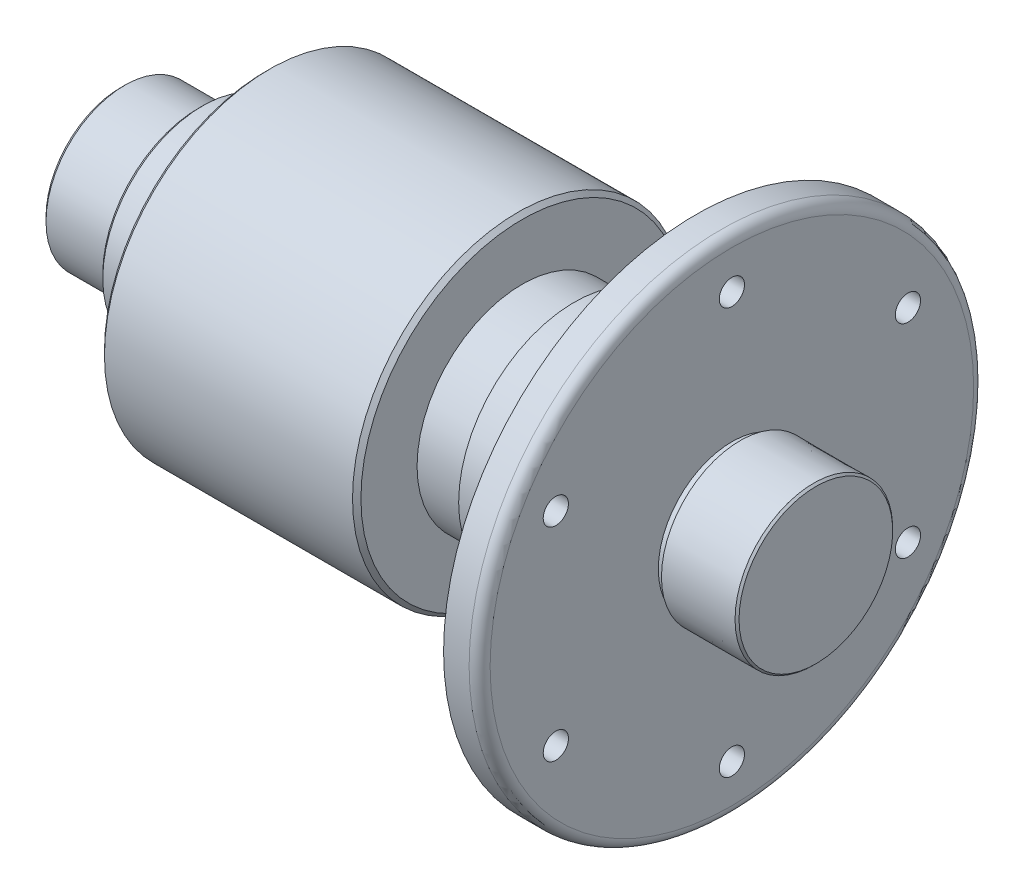
ISO-10303-21;
HEADER;
FILE_DESCRIPTION(('STEP AP214'),'2;1');
FILE_NAME('part.step','',(''),(''),'','','');
FILE_SCHEMA(('AUTOMOTIVE_DESIGN { 1 0 10303 214 1 1 1 1 }'));
ENDSEC;
DATA;
#1=APPLICATION_CONTEXT('core data for automotive mechanical design processes');
#2=APPLICATION_PROTOCOL_DEFINITION('international standard','automotive_design',2000,#1);
#3=PRODUCT_CONTEXT('',#1,'mechanical');
#4=PRODUCT('Part','Part','',(#3));
#5=PRODUCT_RELATED_PRODUCT_CATEGORY('part','',(#4));
#6=PRODUCT_DEFINITION_FORMATION('','',#4);
#7=PRODUCT_DEFINITION_CONTEXT('part definition',#1,'design');
#8=PRODUCT_DEFINITION('design','',#6,#7);
#9=PRODUCT_DEFINITION_SHAPE('','',#8);
#10=(LENGTH_UNIT() NAMED_UNIT(*) SI_UNIT(.MILLI.,.METRE.));
#11=(NAMED_UNIT(*) PLANE_ANGLE_UNIT() SI_UNIT($,.RADIAN.));
#12=(NAMED_UNIT(*) SI_UNIT($,.STERADIAN.) SOLID_ANGLE_UNIT());
#13=UNCERTAINTY_MEASURE_WITH_UNIT(LENGTH_MEASURE(1.E-05),#10,'distance_accuracy_value','');
#14=(GEOMETRIC_REPRESENTATION_CONTEXT(3) GLOBAL_UNCERTAINTY_ASSIGNED_CONTEXT((#13)) GLOBAL_UNIT_ASSIGNED_CONTEXT((#10,
#11,#12)) REPRESENTATION_CONTEXT('',''));
#15=CARTESIAN_POINT('',(0.,0.,0.));
#16=DIRECTION('',(0.,0.,1.));
#17=DIRECTION('',(1.,0.,0.));
#18=AXIS2_PLACEMENT_3D('',#15,#16,#17);
#19=CARTESIAN_POINT('',(25.8615467573256,47.7414329405358,0.));
#20=DIRECTION('',(1.,0.,0.));
#21=DIRECTION('',(0.,0.,-1.));
#22=AXIS2_PLACEMENT_3D('',#19,#20,#21);
#23=CONICAL_SURFACE('',#22,55.0000000000026,1.03037682652439);
#24=CARTESIAN_POINT('',(22.8615467573229,47.7414329405358,0.));
#25=DIRECTION('',(-1.,0.,0.));
#26=DIRECTION('',(0.,0.,1.));
#27=AXIS2_PLACEMENT_3D('',#24,#25,#26);
#28=CIRCLE('',#27,49.9999999999973);
#29=CARTESIAN_POINT('',(22.8615467573229,47.7414329405358,49.9999999999973));
#30=VERTEX_POINT('',#29);
#31=EDGE_CURVE('E11',#30,#30,#28,.T.);
#32=ORIENTED_EDGE('',*,*,#31,.F.);
#33=EDGE_LOOP('',(#32));
#34=FACE_BOUND('',#33,.T.);
#35=CARTESIAN_POINT('',(25.8615467573256,47.7414329405358,0.));
#36=DIRECTION('',(-1.,0.,0.));
#37=DIRECTION('',(0.,0.,1.));
#38=AXIS2_PLACEMENT_3D('',#35,#36,#37);
#39=CIRCLE('',#38,55.0000000000026);
#40=CARTESIAN_POINT('',(25.8615467573256,47.7414329405358,55.0000000000026));
#41=VERTEX_POINT('',#40);
#42=EDGE_CURVE('E75',#41,#41,#39,.T.);
#43=ORIENTED_EDGE('',*,*,#42,.T.);
#44=EDGE_LOOP('',(#43));
#45=FACE_BOUND('',#44,.T.);
#46=ADVANCED_FACE('F37',(#34,#45),#23,.T.);
#47=CARTESIAN_POINT('',(-189.925603217158,47.7414329405358,0.));
#48=DIRECTION('',(-1.,0.,0.));
#49=DIRECTION('',(0.,0.,1.));
#50=AXIS2_PLACEMENT_3D('',#47,#48,#49);
#51=CYLINDRICAL_SURFACE('',#50,49.9999999999973);
#52=CARTESIAN_POINT('',(1.07439678284377,47.7414329405358,0.));
#53=DIRECTION('',(-1.,0.,0.));
#54=DIRECTION('',(0.,0.,1.));
#55=AXIS2_PLACEMENT_3D('',#52,#53,#54);
#56=CIRCLE('',#55,49.9999999999973);
#57=CARTESIAN_POINT('',(1.07439678284377,47.7414329405358,49.9999999999973));
#58=VERTEX_POINT('',#57);
#59=EDGE_CURVE('E43',#58,#58,#56,.T.);
#60=ORIENTED_EDGE('',*,*,#59,.F.);
#61=EDGE_LOOP('',(#60));
#62=FACE_BOUND('',#61,.T.);
#63=ORIENTED_EDGE('',*,*,#31,.T.);
#64=EDGE_LOOP('',(#63));
#65=FACE_BOUND('',#64,.T.);
#66=ADVANCED_FACE('F64',(#62,#65),#51,.T.);
#67=CARTESIAN_POINT('',(1.07439678284305,0.,0.));
#68=DIRECTION('',(1.,0.,0.));
#69=DIRECTION('',(0.,0.,-1.));
#70=AXIS2_PLACEMENT_3D('',#67,#68,#69);
#71=PLANE('',#70);
#72=ORIENTED_EDGE('',*,*,#59,.T.);
#73=EDGE_LOOP('',(#72));
#74=FACE_BOUND('',#73,.T.);
#75=CARTESIAN_POINT('',(1.07439678284232,47.7414329405358,0.));
#76=DIRECTION('',(-1.,0.,0.));
#77=DIRECTION('',(0.,0.,1.));
#78=AXIS2_PLACEMENT_3D('',#75,#76,#77);
#79=CIRCLE('',#78,76.7000000000024);
#80=CARTESIAN_POINT('',(1.07439678284232,47.7414329405358,76.7000000000024));
#81=VERTEX_POINT('',#80);
#82=EDGE_CURVE('E153',#81,#81,#79,.T.);
#83=ORIENTED_EDGE('',*,*,#82,.F.);
#84=EDGE_LOOP('',(#83));
#85=FACE_BOUND('',#84,.T.);
#86=ADVANCED_FACE('F69',(#74,#85),#71,.T.);
#87=CARTESIAN_POINT('',(1.07439678284232,47.7414329405358,0.));
#88=DIRECTION('',(-1.,0.,0.));
#89=DIRECTION('',(0.,0.,1.));
#90=AXIS2_PLACEMENT_3D('',#87,#88,#89);
#91=CONICAL_SURFACE('',#90,76.7000000000024,0.785398163397442);
#92=CARTESIAN_POINT('',(-0.925603217157678,47.7414329405358,0.));
#93=DIRECTION('',(-1.,0.,0.));
#94=DIRECTION('',(0.,0.,1.));
#95=AXIS2_PLACEMENT_3D('',#92,#93,#94);
#96=CIRCLE('',#95,78.7000000000024);
#97=CARTESIAN_POINT('',(-0.925603217157678,47.7414329405358,78.7000000000024));
#98=VERTEX_POINT('',#97);
#99=EDGE_CURVE('E150',#98,#98,#96,.T.);
#100=ORIENTED_EDGE('',*,*,#99,.F.);
#101=EDGE_LOOP('',(#100));
#102=FACE_BOUND('',#101,.T.);
#103=ORIENTED_EDGE('',*,*,#82,.T.);
#104=EDGE_LOOP('',(#103));
#105=FACE_BOUND('',#104,.T.);
#106=ADVANCED_FACE('F161',(#102,#105),#91,.T.);
#107=CARTESIAN_POINT('',(-189.925603217158,47.7414329405358,0.));
#108=DIRECTION('',(-1.,0.,0.));
#109=DIRECTION('',(0.,0.,1.));
#110=AXIS2_PLACEMENT_3D('',#107,#108,#109);
#111=CYLINDRICAL_SURFACE('',#110,78.7000000000018);
#112=CARTESIAN_POINT('',(-118.925603217158,47.7414329405358,0.));
#113=DIRECTION('',(-1.,0.,0.));
#114=DIRECTION('',(0.,0.,1.));
#115=AXIS2_PLACEMENT_3D('',#112,#113,#114);
#116=CIRCLE('',#115,78.7000000000012);
#117=CARTESIAN_POINT('',(-118.925603217158,47.7414329405358,78.7000000000012));
#118=VERTEX_POINT('',#117);
#119=EDGE_CURVE('E147',#118,#118,#116,.T.);
#120=ORIENTED_EDGE('',*,*,#119,.F.);
#121=EDGE_LOOP('',(#120));
#122=FACE_BOUND('',#121,.T.);
#123=ORIENTED_EDGE('',*,*,#99,.T.);
#124=EDGE_LOOP('',(#123));
#125=FACE_BOUND('',#124,.T.);
#126=ADVANCED_FACE('F166',(#122,#125),#111,.T.);
#127=CARTESIAN_POINT('',(-118.925603217158,47.7414329405358,0.));
#128=DIRECTION('',(1.,0.,0.));
#129=DIRECTION('',(0.,0.,-1.));
#130=AXIS2_PLACEMENT_3D('',#127,#128,#129);
#131=CONICAL_SURFACE('',#130,78.7000000000012,0.785398163397445);
#132=CARTESIAN_POINT('',(-120.925603217158,47.7414329405358,0.));
#133=DIRECTION('',(-1.,0.,0.));
#134=DIRECTION('',(0.,0.,1.));
#135=AXIS2_PLACEMENT_3D('',#132,#133,#134);
#136=CIRCLE('',#135,76.7000000000013);
#137=CARTESIAN_POINT('',(-120.925603217158,47.7414329405358,76.7000000000013));
#138=VERTEX_POINT('',#137);
#139=EDGE_CURVE('E144',#138,#138,#136,.T.);
#140=ORIENTED_EDGE('',*,*,#139,.F.);
#141=EDGE_LOOP('',(#140));
#142=FACE_BOUND('',#141,.T.);
#143=ORIENTED_EDGE('',*,*,#119,.T.);
#144=EDGE_LOOP('',(#143));
#145=FACE_BOUND('',#144,.T.);
#146=ADVANCED_FACE('F172',(#142,#145),#131,.T.);
#147=CARTESIAN_POINT('',(-120.925603217157,-2.81612374099351E-12,0.));
#148=DIRECTION('',(-1.,0.,0.));
#149=DIRECTION('',(0.,0.,1.));
#150=AXIS2_PLACEMENT_3D('',#147,#148,#149);
#151=PLANE('',#150);
#152=ORIENTED_EDGE('',*,*,#139,.T.);
#153=EDGE_LOOP('',(#152));
#154=FACE_BOUND('',#153,.T.);
#155=CARTESIAN_POINT('',(-120.925603217157,47.7414329405358,0.));
#156=DIRECTION('',(-1.,0.,0.));
#157=DIRECTION('',(0.,0.,1.));
#158=AXIS2_PLACEMENT_3D('',#155,#156,#157);
#159=CIRCLE('',#158,47.5000000000042);
#160=CARTESIAN_POINT('',(-120.925603217157,47.7414329405358,47.5000000000042));
#161=VERTEX_POINT('',#160);
#162=EDGE_CURVE('E141',#161,#161,#159,.T.);
#163=ORIENTED_EDGE('',*,*,#162,.F.);
#164=EDGE_LOOP('',(#163));
#165=FACE_BOUND('',#164,.T.);
#166=ADVANCED_FACE('F179',(#154,#165),#151,.T.);
#167=CARTESIAN_POINT('',(-189.925603217158,47.7414329405358,0.));
#168=DIRECTION('',(-1.,0.,0.));
#169=DIRECTION('',(0.,0.,1.));
#170=AXIS2_PLACEMENT_3D('',#167,#168,#169);
#171=CYLINDRICAL_SURFACE('',#170,47.5000000000042);
#172=CARTESIAN_POINT('',(-150.925603217157,47.7414329405358,0.));
#173=DIRECTION('',(-1.,0.,0.));
#174=DIRECTION('',(0.,0.,1.));
#175=AXIS2_PLACEMENT_3D('',#172,#173,#174);
#176=CIRCLE('',#175,47.5000000000042);
#177=CARTESIAN_POINT('',(-150.925603217157,47.7414329405358,47.5000000000042));
#178=VERTEX_POINT('',#177);
#179=EDGE_CURVE('E138',#178,#178,#176,.T.);
#180=ORIENTED_EDGE('',*,*,#179,.F.);
#181=EDGE_LOOP('',(#180));
#182=FACE_BOUND('',#181,.T.);
#183=ORIENTED_EDGE('',*,*,#162,.T.);
#184=EDGE_LOOP('',(#183));
#185=FACE_BOUND('',#184,.T.);
#186=ADVANCED_FACE('F183',(#182,#185),#171,.T.);
#187=CARTESIAN_POINT('',(-150.925603217157,47.7414329405358,0.));
#188=DIRECTION('',(1.,0.,0.));
#189=DIRECTION('',(0.,0.,-1.));
#190=AXIS2_PLACEMENT_3D('',#187,#188,#189);
#191=CONICAL_SURFACE('',#190,47.5000000000042,0.785398163397445);
#192=CARTESIAN_POINT('',(-152.925603217157,47.7414329405358,0.));
#193=DIRECTION('',(-1.,0.,0.));
#194=DIRECTION('',(0.,0.,1.));
#195=AXIS2_PLACEMENT_3D('',#192,#193,#194);
#196=CIRCLE('',#195,45.5000000000037);
#197=CARTESIAN_POINT('',(-152.925603217157,47.7414329405358,45.5000000000037));
#198=VERTEX_POINT('',#197);
#199=EDGE_CURVE('E135',#198,#198,#196,.T.);
#200=ORIENTED_EDGE('',*,*,#199,.F.);
#201=EDGE_LOOP('',(#200));
#202=FACE_BOUND('',#201,.T.);
#203=ORIENTED_EDGE('',*,*,#179,.T.);
#204=EDGE_LOOP('',(#203));
#205=FACE_BOUND('',#204,.T.);
#206=ADVANCED_FACE('F187',(#202,#205),#191,.T.);
#207=CARTESIAN_POINT('',(-152.925603217157,3.23393382373946E-12,0.));
#208=DIRECTION('',(1.,0.,0.));
#209=DIRECTION('',(0.,0.,-1.));
#210=AXIS2_PLACEMENT_3D('',#207,#208,#209);
#211=PLANE('',#210);
#212=CARTESIAN_POINT('',(-152.925603217158,47.7414329405358,0.));
#213=DIRECTION('',(-1.,0.,0.));
#214=DIRECTION('',(0.,0.,1.));
#215=AXIS2_PLACEMENT_3D('',#212,#213,#214);
#216=CIRCLE('',#215,35.);
#217=CARTESIAN_POINT('',(-152.925603217158,47.7414329405358,35.));
#218=VERTEX_POINT('',#217);
#219=EDGE_CURVE('E132',#218,#218,#216,.T.);
#220=ORIENTED_EDGE('',*,*,#219,.F.);
#221=EDGE_LOOP('',(#220));
#222=FACE_BOUND('',#221,.T.);
#223=ORIENTED_EDGE('',*,*,#199,.T.);
#224=EDGE_LOOP('',(#223));
#225=FACE_BOUND('',#224,.T.);
#226=ADVANCED_FACE('F191',(#222,#225),#211,.F.);
#227=CARTESIAN_POINT('',(-189.925603217158,47.7414329405358,0.));
#228=DIRECTION('',(-1.,0.,0.));
#229=DIRECTION('',(0.,0.,1.));
#230=AXIS2_PLACEMENT_3D('',#227,#228,#229);
#231=CYLINDRICAL_SURFACE('',#230,35.);
#232=CARTESIAN_POINT('',(-155.925603217158,47.7414329405358,0.));
#233=DIRECTION('',(-1.,0.,0.));
#234=DIRECTION('',(0.,0.,1.));
#235=AXIS2_PLACEMENT_3D('',#232,#233,#234);
#236=CIRCLE('',#235,35.);
#237=CARTESIAN_POINT('',(-155.925603217158,47.7414329405358,35.));
#238=VERTEX_POINT('',#237);
#239=EDGE_CURVE('E129',#238,#238,#236,.T.);
#240=ORIENTED_EDGE('',*,*,#239,.F.);
#241=EDGE_LOOP('',(#240));
#242=FACE_BOUND('',#241,.T.);
#243=ORIENTED_EDGE('',*,*,#219,.T.);
#244=EDGE_LOOP('',(#243));
#245=FACE_BOUND('',#244,.T.);
#246=ADVANCED_FACE('F195',(#242,#245),#231,.T.);
#247=CARTESIAN_POINT('',(-155.925603217158,0.,0.));
#248=DIRECTION('',(-1.,0.,0.));
#249=DIRECTION('',(0.,0.,1.));
#250=AXIS2_PLACEMENT_3D('',#247,#248,#249);
#251=PLANE('',#250);
#252=CARTESIAN_POINT('',(-155.925603217158,47.7414329405358,0.));
#253=DIRECTION('',(-1.,0.,0.));
#254=DIRECTION('',(0.,0.,1.));
#255=AXIS2_PLACEMENT_3D('',#252,#253,#254);
#256=CIRCLE('',#255,37.5);
#257=CARTESIAN_POINT('',(-155.925603217158,47.7414329405358,37.5));
#258=VERTEX_POINT('',#257);
#259=EDGE_CURVE('E126',#258,#258,#256,.T.);
#260=ORIENTED_EDGE('',*,*,#259,.F.);
#261=EDGE_LOOP('',(#260));
#262=FACE_BOUND('',#261,.T.);
#263=ORIENTED_EDGE('',*,*,#239,.T.);
#264=EDGE_LOOP('',(#263));
#265=FACE_BOUND('',#264,.T.);
#266=ADVANCED_FACE('F199',(#262,#265),#251,.F.);
#267=CARTESIAN_POINT('',(-189.925603217158,47.7414329405358,0.));
#268=DIRECTION('',(-1.,0.,0.));
#269=DIRECTION('',(0.,0.,1.));
#270=AXIS2_PLACEMENT_3D('',#267,#268,#269);
#271=CYLINDRICAL_SURFACE('',#270,37.5);
#272=CARTESIAN_POINT('',(-187.925603217158,47.7414329405358,0.));
#273=DIRECTION('',(-1.,0.,0.));
#274=DIRECTION('',(0.,0.,1.));
#275=AXIS2_PLACEMENT_3D('',#272,#273,#274);
#276=CIRCLE('',#275,37.5);
#277=CARTESIAN_POINT('',(-187.925603217158,47.7414329405358,37.5));
#278=VERTEX_POINT('',#277);
#279=EDGE_CURVE('E123',#278,#278,#276,.T.);
#280=ORIENTED_EDGE('',*,*,#279,.F.);
#281=EDGE_LOOP('',(#280));
#282=FACE_BOUND('',#281,.T.);
#283=ORIENTED_EDGE('',*,*,#259,.T.);
#284=EDGE_LOOP('',(#283));
#285=FACE_BOUND('',#284,.T.);
#286=ADVANCED_FACE('F203',(#282,#285),#271,.T.);
#287=CARTESIAN_POINT('',(-187.925603217158,47.7414329405358,0.));
#288=DIRECTION('',(1.,0.,0.));
#289=DIRECTION('',(0.,0.,-1.));
#290=AXIS2_PLACEMENT_3D('',#287,#288,#289);
#291=CONICAL_SURFACE('',#290,37.5,0.78539816339766);
#292=CARTESIAN_POINT('',(-189.925603217158,47.7414329405358,0.));
#293=DIRECTION('',(-1.,0.,0.));
#294=DIRECTION('',(0.,0.,1.));
#295=AXIS2_PLACEMENT_3D('',#292,#293,#294);
#296=CIRCLE('',#295,35.5);
#297=CARTESIAN_POINT('',(-189.925603217158,47.7414329405358,35.5));
#298=VERTEX_POINT('',#297);
#299=EDGE_CURVE('E120',#298,#298,#296,.T.);
#300=ORIENTED_EDGE('',*,*,#299,.F.);
#301=EDGE_LOOP('',(#300));
#302=FACE_BOUND('',#301,.T.);
#303=ORIENTED_EDGE('',*,*,#279,.T.);
#304=EDGE_LOOP('',(#303));
#305=FACE_BOUND('',#304,.T.);
#306=ADVANCED_FACE('F59',(#302,#305),#291,.T.);
#307=CARTESIAN_POINT('',(-189.925603217158,5.93971204669043E-13,0.));
#308=DIRECTION('',(-1.,0.,0.));
#309=DIRECTION('',(0.,0.,1.));
#310=AXIS2_PLACEMENT_3D('',#307,#308,#309);
#311=PLANE('',#310);
#312=ORIENTED_EDGE('',*,*,#299,.T.);
#313=EDGE_LOOP('',(#312));
#314=FACE_BOUND('',#313,.T.);
#315=ADVANCED_FACE('F49',(#314),#311,.T.);
#316=CARTESIAN_POINT('',(140.832653038409,47.7414329405358,0.));
#317=DIRECTION('',(-1.,0.,0.));
#318=DIRECTION('',(0.,0.,1.));
#319=AXIS2_PLACEMENT_3D('',#316,#317,#318);
#320=CONICAL_SURFACE('',#319,0.,1.56931244625037);
#321=CARTESIAN_POINT('',(140.778414132889,47.7414329405358,0.));
#322=DIRECTION('',(-1.,0.,0.));
#323=DIRECTION('',(0.,0.,1.));
#324=AXIS2_PLACEMENT_3D('',#321,#322,#323);
#325=CIRCLE('',#324,36.5520431616561);
#326=CARTESIAN_POINT('',(140.778414132889,47.7414329405358,36.5520431616561));
#327=VERTEX_POINT('',#326);
#328=EDGE_CURVE('E117',#327,#327,#325,.T.);
#329=ORIENTED_EDGE('',*,*,#328,.F.);
#330=EDGE_LOOP('',(#329));
#331=FACE_BOUND('',#330,.T.);
#332=CARTESIAN_POINT('',(140.832653038409,47.7414329405358,0.));
#333=VERTEX_POINT('',#332);
#334=VERTEX_LOOP('',#333);
#335=FACE_BOUND('',#334,.T.);
#336=ADVANCED_FACE('F46',(#331,#335),#320,.T.);
#337=CARTESIAN_POINT('',(140.778414132889,47.7414329405358,0.));
#338=DIRECTION('',(-1.,0.,0.));
#339=DIRECTION('',(0.,0.,1.));
#340=AXIS2_PLACEMENT_3D('',#337,#338,#339);
#341=CONICAL_SURFACE('',#340,36.5520431616561,0.785398163397441);
#342=CARTESIAN_POINT('',(139.832288889932,47.7414329405358,0.));
#343=DIRECTION('',(-1.,0.,0.));
#344=DIRECTION('',(0.,0.,1.));
#345=AXIS2_PLACEMENT_3D('',#342,#343,#344);
#346=CIRCLE('',#345,37.498168404613);
#347=CARTESIAN_POINT('',(139.832288889932,47.7414329405358,37.498168404613));
#348=VERTEX_POINT('',#347);
#349=EDGE_CURVE('E114',#348,#348,#346,.T.);
#350=ORIENTED_EDGE('',*,*,#349,.F.);
#351=EDGE_LOOP('',(#350));
#352=FACE_BOUND('',#351,.T.);
#353=ORIENTED_EDGE('',*,*,#328,.T.);
#354=EDGE_LOOP('',(#353));
#355=FACE_BOUND('',#354,.T.);
#356=ADVANCED_FACE('F48',(#352,#355),#341,.T.);
#357=CARTESIAN_POINT('',(139.832288889932,0.,0.));
#358=DIRECTION('',(1.,0.,0.));
#359=DIRECTION('',(0.,0.,-1.));
#360=AXIS2_PLACEMENT_3D('',#357,#358,#359);
#361=PLANE('',#360);
#362=ORIENTED_EDGE('',*,*,#349,.T.);
#363=EDGE_LOOP('',(#362));
#364=FACE_BOUND('',#363,.T.);
#365=CARTESIAN_POINT('',(139.832288889932,47.7414329405358,0.));
#366=DIRECTION('',(-1.,0.,0.));
#367=DIRECTION('',(0.,0.,1.));
#368=AXIS2_PLACEMENT_3D('',#365,#366,#367);
#369=CIRCLE('',#368,37.5000000000024);
#370=CARTESIAN_POINT('',(139.832288889932,47.7414329405358,37.5000000000024));
#371=VERTEX_POINT('',#370);
#372=EDGE_CURVE('E111',#371,#371,#369,.T.);
#373=ORIENTED_EDGE('',*,*,#372,.F.);
#374=EDGE_LOOP('',(#373));
#375=FACE_BOUND('',#374,.T.);
#376=ADVANCED_FACE('F56',(#364,#375),#361,.T.);
#377=CARTESIAN_POINT('',(139.832288889932,47.7414329405358,0.));
#378=DIRECTION('',(1.,0.,0.));
#379=DIRECTION('',(0.,0.,-1.));
#380=AXIS2_PLACEMENT_3D('',#377,#378,#379);
#381=CONICAL_SURFACE('',#380,37.5000000000024,5.23312967933687E-05);
#382=CARTESIAN_POINT('',(104.832288889932,47.7414329405358,0.));
#383=DIRECTION('',(-1.,0.,0.));
#384=DIRECTION('',(0.,0.,1.));
#385=AXIS2_PLACEMENT_3D('',#382,#383,#384);
#386=CIRCLE('',#385,37.498168404613);
#387=CARTESIAN_POINT('',(104.832288889932,47.7414329405358,37.498168404613));
#388=VERTEX_POINT('',#387);
#389=EDGE_CURVE('E108',#388,#388,#386,.T.);
#390=ORIENTED_EDGE('',*,*,#389,.F.);
#391=EDGE_LOOP('',(#390));
#392=FACE_BOUND('',#391,.T.);
#393=ORIENTED_EDGE('',*,*,#372,.T.);
#394=EDGE_LOOP('',(#393));
#395=FACE_BOUND('',#394,.T.);
#396=ADVANCED_FACE('F254',(#392,#395),#381,.T.);
#397=CARTESIAN_POINT('',(104.832288889932,0.,0.));
#398=DIRECTION('',(-1.,0.,0.));
#399=DIRECTION('',(0.,0.,1.));
#400=AXIS2_PLACEMENT_3D('',#397,#398,#399);
#401=PLANE('',#400);
#402=ORIENTED_EDGE('',*,*,#389,.T.);
#403=EDGE_LOOP('',(#402));
#404=FACE_BOUND('',#403,.T.);
#405=CARTESIAN_POINT('',(104.832288889932,47.7414329405358,0.));
#406=DIRECTION('',(-1.,0.,0.));
#407=DIRECTION('',(0.,0.,1.));
#408=AXIS2_PLACEMENT_3D('',#405,#406,#407);
#409=CIRCLE('',#408,35.0000000000044);
#410=CARTESIAN_POINT('',(104.832288889932,47.7414329405358,35.0000000000044));
#411=VERTEX_POINT('',#410);
#412=EDGE_CURVE('E105',#411,#411,#409,.T.);
#413=ORIENTED_EDGE('',*,*,#412,.F.);
#414=EDGE_LOOP('',(#413));
#415=FACE_BOUND('',#414,.T.);
#416=ADVANCED_FACE('F264',(#404,#415),#401,.T.);
#417=CARTESIAN_POINT('',(-189.925603217158,47.7414329405358,0.));
#418=DIRECTION('',(-1.,0.,0.));
#419=DIRECTION('',(0.,0.,1.));
#420=AXIS2_PLACEMENT_3D('',#417,#418,#419);
#421=CYLINDRICAL_SURFACE('',#420,35.0000000000044);
#422=CARTESIAN_POINT('',(100.832288889933,47.7414329405358,0.));
#423=DIRECTION('',(-1.,0.,0.));
#424=DIRECTION('',(0.,0.,1.));
#425=AXIS2_PLACEMENT_3D('',#422,#423,#424);
#426=CIRCLE('',#425,35.0000000000044);
#427=CARTESIAN_POINT('',(100.832288889933,47.7414329405358,35.0000000000044));
#428=VERTEX_POINT('',#427);
#429=EDGE_CURVE('E102',#428,#428,#426,.T.);
#430=ORIENTED_EDGE('',*,*,#429,.F.);
#431=EDGE_LOOP('',(#430));
#432=FACE_BOUND('',#431,.T.);
#433=ORIENTED_EDGE('',*,*,#412,.T.);
#434=EDGE_LOOP('',(#433));
#435=FACE_BOUND('',#434,.T.);
#436=ADVANCED_FACE('F274',(#432,#435),#421,.T.);
#437=CARTESIAN_POINT('',(100.832288889933,0.,0.));
#438=DIRECTION('',(-1.,0.,0.));
#439=DIRECTION('',(0.,0.,1.));
#440=AXIS2_PLACEMENT_3D('',#437,#438,#439);
#441=PLANE('',#440);
#442=CARTESIAN_POINT('',(100.832288889933,96.0914329405368,83.7446565459547));
#443=DIRECTION('',(-1.,0.,0.));
#444=DIRECTION('',(0.,0.,1.));
#445=AXIS2_PLACEMENT_3D('',#442,#443,#444);
#446=CIRCLE('',#445,6.);
#447=CARTESIAN_POINT('',(100.832288889933,96.0914329405368,89.7446565459547));
#448=VERTEX_POINT('',#447);
#449=EDGE_CURVE('E425',#448,#448,#446,.T.);
#450=ORIENTED_EDGE('',*,*,#449,.T.);
#451=EDGE_LOOP('',(#450));
#452=FACE_BOUND('',#451,.T.);
#453=CARTESIAN_POINT('',(100.832288889933,-0.608567059463438,83.7446565459557));
#454=DIRECTION('',(-1.,0.,0.));
#455=DIRECTION('',(0.,0.,1.));
#456=AXIS2_PLACEMENT_3D('',#453,#454,#455);
#457=CIRCLE('',#456,6.);
#458=CARTESIAN_POINT('',(100.832288889933,-0.608567059463438,89.7446565459557));
#459=VERTEX_POINT('',#458);
#460=EDGE_CURVE('E429',#459,#459,#457,.T.);
#461=ORIENTED_EDGE('',*,*,#460,.T.);
#462=EDGE_LOOP('',(#461));
#463=FACE_BOUND('',#462,.T.);
#464=CARTESIAN_POINT('',(100.832288889933,-48.9585670594642,0.));
#465=DIRECTION('',(-1.,0.,0.));
#466=DIRECTION('',(0.,0.,1.));
#467=AXIS2_PLACEMENT_3D('',#464,#465,#466);
#468=CIRCLE('',#467,6.);
#469=CARTESIAN_POINT('',(100.832288889933,-48.9585670594642,6.));
#470=VERTEX_POINT('',#469);
#471=EDGE_CURVE('E438',#470,#470,#468,.T.);
#472=ORIENTED_EDGE('',*,*,#471,.T.);
#473=EDGE_LOOP('',(#472));
#474=FACE_BOUND('',#473,.T.);
#475=CARTESIAN_POINT('',(100.832288889933,-0.608567059464618,-83.744656545955));
#476=DIRECTION('',(-1.,0.,0.));
#477=DIRECTION('',(0.,0.,1.));
#478=AXIS2_PLACEMENT_3D('',#475,#476,#477);
#479=CIRCLE('',#478,6.);
#480=CARTESIAN_POINT('',(100.832288889933,-0.608567059464618,-77.744656545955));
#481=VERTEX_POINT('',#480);
#482=EDGE_CURVE('E444',#481,#481,#479,.T.);
#483=ORIENTED_EDGE('',*,*,#482,.T.);
#484=EDGE_LOOP('',(#483));
#485=FACE_BOUND('',#484,.T.);
#486=CARTESIAN_POINT('',(100.832288889933,96.0914329405356,-83.7446565459554));
#487=DIRECTION('',(-1.,0.,0.));
#488=DIRECTION('',(0.,0.,1.));
#489=AXIS2_PLACEMENT_3D('',#486,#487,#488);
#490=CIRCLE('',#489,6.);
#491=CARTESIAN_POINT('',(100.832288889933,96.0914329405356,-77.7446565459554));
#492=VERTEX_POINT('',#491);
#493=EDGE_CURVE('E450',#492,#492,#490,.T.);
#494=ORIENTED_EDGE('',*,*,#493,.T.);
#495=EDGE_LOOP('',(#494));
#496=FACE_BOUND('',#495,.T.);
#497=CARTESIAN_POINT('',(100.832288889933,144.441432940536,0.));
#498=DIRECTION('',(-1.,0.,0.));
#499=DIRECTION('',(0.,0.,1.));
#500=AXIS2_PLACEMENT_3D('',#497,#498,#499);
#501=CIRCLE('',#500,6.);
#502=CARTESIAN_POINT('',(100.832288889933,144.441432940536,6.));
#503=VERTEX_POINT('',#502);
#504=EDGE_CURVE('E78',#503,#503,#501,.T.);
#505=ORIENTED_EDGE('',*,*,#504,.T.);
#506=EDGE_LOOP('',(#505));
#507=FACE_BOUND('',#506,.T.);
#508=CARTESIAN_POINT('',(100.832288889933,47.7414329405358,0.));
#509=DIRECTION('',(-1.,0.,0.));
#510=DIRECTION('',(0.,0.,1.));
#511=AXIS2_PLACEMENT_3D('',#508,#509,#510);
#512=CIRCLE('',#511,115.000816318206);
#513=CARTESIAN_POINT('',(100.832288889933,47.7414329405358,115.000816318206));
#514=VERTEX_POINT('',#513);
#515=EDGE_CURVE('E99',#514,#514,#512,.T.);
#516=ORIENTED_EDGE('',*,*,#515,.F.);
#517=EDGE_LOOP('',(#516));
#518=FACE_BOUND('',#517,.T.);
#519=ORIENTED_EDGE('',*,*,#429,.T.);
#520=EDGE_LOOP('',(#519));
#521=FACE_BOUND('',#520,.T.);
#522=ADVANCED_FACE('F284',(#452,#463,#474,#485,#496,#507,#518,#521),#441,.F.);
#523=CARTESIAN_POINT('',(95.8322888906133,47.7414329405358,0.));
#524=DIRECTION('',(-1.,0.,0.));
#525=DIRECTION('',(0.,0.,1.));
#526=AXIS2_PLACEMENT_3D('',#523,#524,#525);
#527=TOROIDAL_SURFACE('',#526,115.000816318715,4.99999999931987);
#528=CARTESIAN_POINT('',(95.8322888893134,47.7414329405358,0.));
#529=DIRECTION('',(-1.,0.,0.));
#530=DIRECTION('',(0.,0.,1.));
#531=AXIS2_PLACEMENT_3D('',#528,#529,#530);
#532=CIRCLE('',#531,120.000816318034);
#533=CARTESIAN_POINT('',(95.8322888893134,47.7414329405358,120.000816318034));
#534=VERTEX_POINT('',#533);
#535=EDGE_CURVE('E96',#534,#534,#532,.T.);
#536=ORIENTED_EDGE('',*,*,#535,.F.);
#537=EDGE_LOOP('',(#536));
#538=FACE_BOUND('',#537,.T.);
#539=ORIENTED_EDGE('',*,*,#515,.T.);
#540=EDGE_LOOP('',(#539));
#541=FACE_BOUND('',#540,.T.);
#542=ADVANCED_FACE('F292',(#538,#541),#527,.T.);
#543=CARTESIAN_POINT('',(-189.925603217158,47.7414329405358,0.));
#544=DIRECTION('',(-1.,0.,0.));
#545=DIRECTION('',(0.,0.,1.));
#546=AXIS2_PLACEMENT_3D('',#543,#544,#545);
#547=CYLINDRICAL_SURFACE('',#546,120.000816318034);
#548=CARTESIAN_POINT('',(83.6855711486046,47.7414329405358,0.));
#549=DIRECTION('',(-1.,0.,0.));
#550=DIRECTION('',(0.,0.,1.));
#551=AXIS2_PLACEMENT_3D('',#548,#549,#550);
#552=CIRCLE('',#551,120.000816318034);
#553=CARTESIAN_POINT('',(83.6855711486046,47.7414329405358,120.000816318034));
#554=VERTEX_POINT('',#553);
#555=EDGE_CURVE('E93',#554,#554,#552,.T.);
#556=ORIENTED_EDGE('',*,*,#555,.F.);
#557=EDGE_LOOP('',(#556));
#558=FACE_BOUND('',#557,.T.);
#559=ORIENTED_EDGE('',*,*,#535,.T.);
#560=EDGE_LOOP('',(#559));
#561=FACE_BOUND('',#560,.T.);
#562=ADVANCED_FACE('F297',(#558,#561),#547,.T.);
#563=CARTESIAN_POINT('',(83.6855711486046,0.,0.));
#564=DIRECTION('',(-1.,0.,0.));
#565=DIRECTION('',(0.,0.,1.));
#566=AXIS2_PLACEMENT_3D('',#563,#564,#565);
#567=PLANE('',#566);
#568=CARTESIAN_POINT('',(83.6855711486046,96.0914329405368,83.7446565459547));
#569=DIRECTION('',(-1.,0.,0.));
#570=DIRECTION('',(0.,-0.866025403784433,0.50000000000001));
#571=AXIS2_PLACEMENT_3D('',#568,#569,#570);
#572=CIRCLE('',#571,6.);
#573=CARTESIAN_POINT('',(83.6855711486046,90.8952805178302,86.7446565459547));
#574=VERTEX_POINT('',#573);
#575=EDGE_CURVE('E422',#574,#574,#572,.T.);
#576=ORIENTED_EDGE('',*,*,#575,.F.);
#577=EDGE_LOOP('',(#576));
#578=FACE_BOUND('',#577,.T.);
#579=CARTESIAN_POINT('',(83.6855711486046,-0.608567059463438,83.7446565459557));
#580=DIRECTION('',(-1.,0.,0.));
#581=DIRECTION('',(0.,-0.866025403784443,-0.499999999999992));
#582=AXIS2_PLACEMENT_3D('',#579,#580,#581);
#583=CIRCLE('',#582,6.);
#584=CARTESIAN_POINT('',(83.6855711486046,-5.8047194821701,80.7446565459557));
#585=VERTEX_POINT('',#584);
#586=EDGE_CURVE('E426',#585,#585,#583,.T.);
#587=ORIENTED_EDGE('',*,*,#586,.F.);
#588=EDGE_LOOP('',(#587));
#589=FACE_BOUND('',#588,.T.);
#590=CARTESIAN_POINT('',(83.6855711486046,-48.9585670594642,0.));
#591=DIRECTION('',(-1.,0.,0.));
#592=DIRECTION('',(0.,0.,-1.));
#593=AXIS2_PLACEMENT_3D('',#590,#591,#592);
#594=CIRCLE('',#593,6.);
#595=CARTESIAN_POINT('',(83.6855711486046,-48.9585670594642,-6.));
#596=VERTEX_POINT('',#595);
#597=EDGE_CURVE('E435',#596,#596,#594,.T.);
#598=ORIENTED_EDGE('',*,*,#597,.F.);
#599=EDGE_LOOP('',(#598));
#600=FACE_BOUND('',#599,.T.);
#601=CARTESIAN_POINT('',(83.6855711486046,-0.608567059464618,-83.744656545955));
#602=DIRECTION('',(-1.,0.,0.));
#603=DIRECTION('',(0.,0.866025403784436,-0.500000000000004));
#604=AXIS2_PLACEMENT_3D('',#601,#602,#603);
#605=CIRCLE('',#604,6.);
#606=CARTESIAN_POINT('',(83.6855711486046,4.587585363242,-86.744656545955));
#607=VERTEX_POINT('',#606);
#608=EDGE_CURVE('E441',#607,#607,#605,.T.);
#609=ORIENTED_EDGE('',*,*,#608,.F.);
#610=EDGE_LOOP('',(#609));
#611=FACE_BOUND('',#610,.T.);
#612=CARTESIAN_POINT('',(83.6855711486046,96.0914329405356,-83.7446565459554));
#613=DIRECTION('',(-1.,0.,0.));
#614=DIRECTION('',(0.,0.86602540378444,0.499999999999998));
#615=AXIS2_PLACEMENT_3D('',#612,#613,#614);
#616=CIRCLE('',#615,6.);
#617=CARTESIAN_POINT('',(83.6855711486046,101.287585363242,-80.7446565459554));
#618=VERTEX_POINT('',#617);
#619=EDGE_CURVE('E447',#618,#618,#616,.T.);
#620=ORIENTED_EDGE('',*,*,#619,.F.);
#621=EDGE_LOOP('',(#620));
#622=FACE_BOUND('',#621,.T.);
#623=CARTESIAN_POINT('',(83.6855711486046,144.441432940536,0.));
#624=DIRECTION('',(-1.,0.,0.));
#625=DIRECTION('',(0.,0.,1.));
#626=AXIS2_PLACEMENT_3D('',#623,#624,#625);
#627=CIRCLE('',#626,6.);
#628=CARTESIAN_POINT('',(83.6855711486046,144.441432940536,6.));
#629=VERTEX_POINT('',#628);
#630=EDGE_CURVE('E84',#629,#629,#627,.T.);
#631=ORIENTED_EDGE('',*,*,#630,.F.);
#632=EDGE_LOOP('',(#631));
#633=FACE_BOUND('',#632,.T.);
#634=ORIENTED_EDGE('',*,*,#555,.T.);
#635=EDGE_LOOP('',(#634));
#636=FACE_BOUND('',#635,.T.);
#637=CARTESIAN_POINT('',(83.6855711486046,47.7414329405358,0.));
#638=DIRECTION('',(-1.,0.,0.));
#639=DIRECTION('',(0.,0.,1.));
#640=AXIS2_PLACEMENT_3D('',#637,#638,#639);
#641=CIRCLE('',#640,81.7000000000051);
#642=CARTESIAN_POINT('',(83.6855711486046,47.7414329405358,81.7000000000051));
#643=VERTEX_POINT('',#642);
#644=EDGE_CURVE('E90',#643,#643,#641,.T.);
#645=ORIENTED_EDGE('',*,*,#644,.F.);
#646=EDGE_LOOP('',(#645));
#647=FACE_BOUND('',#646,.T.);
#648=ADVANCED_FACE('F308',(#578,#589,#600,#611,#622,#633,#636,#647),#567,.T.);
#649=CARTESIAN_POINT('',(-189.925603217158,47.7414329405358,0.));
#650=DIRECTION('',(-1.,0.,0.));
#651=DIRECTION('',(0.,0.,1.));
#652=AXIS2_PLACEMENT_3D('',#649,#650,#651);
#653=CYLINDRICAL_SURFACE('',#652,81.7000000000051);
#654=CARTESIAN_POINT('',(65.8322888899324,47.7414329405358,0.));
#655=DIRECTION('',(-1.,0.,0.));
#656=DIRECTION('',(0.,0.,1.));
#657=AXIS2_PLACEMENT_3D('',#654,#655,#656);
#658=CIRCLE('',#657,81.7000000000051);
#659=CARTESIAN_POINT('',(65.8322888899324,47.7414329405358,81.7000000000051));
#660=VERTEX_POINT('',#659);
#661=EDGE_CURVE('E81',#660,#660,#658,.T.);
#662=ORIENTED_EDGE('',*,*,#661,.F.);
#663=EDGE_LOOP('',(#662));
#664=FACE_BOUND('',#663,.T.);
#665=ORIENTED_EDGE('',*,*,#644,.T.);
#666=EDGE_LOOP('',(#665));
#667=FACE_BOUND('',#666,.T.);
#668=ADVANCED_FACE('F316',(#664,#667),#653,.T.);
#669=CARTESIAN_POINT('',(65.8322888899324,0.,0.));
#670=DIRECTION('',(1.,0.,0.));
#671=DIRECTION('',(0.,0.,-1.));
#672=AXIS2_PLACEMENT_3D('',#669,#670,#671);
#673=PLANE('',#672);
#674=CARTESIAN_POINT('',(65.8322888899324,47.7414329405358,0.));
#675=DIRECTION('',(-1.,0.,0.));
#676=DIRECTION('',(0.,0.,1.));
#677=AXIS2_PLACEMENT_3D('',#674,#675,#676);
#678=CIRCLE('',#677,55.0000000000022);
#679=CARTESIAN_POINT('',(65.8322888899324,47.7414329405358,55.0000000000022));
#680=VERTEX_POINT('',#679);
#681=EDGE_CURVE('E77',#680,#680,#678,.T.);
#682=ORIENTED_EDGE('',*,*,#681,.F.);
#683=EDGE_LOOP('',(#682));
#684=FACE_BOUND('',#683,.T.);
#685=ORIENTED_EDGE('',*,*,#661,.T.);
#686=EDGE_LOOP('',(#685));
#687=FACE_BOUND('',#686,.T.);
#688=ADVANCED_FACE('F321',(#684,#687),#673,.F.);
#689=CARTESIAN_POINT('',(-189.925603217158,47.7414329405358,0.));
#690=DIRECTION('',(-1.,0.,0.));
#691=DIRECTION('',(0.,0.,1.));
#692=AXIS2_PLACEMENT_3D('',#689,#690,#691);
#693=CYLINDRICAL_SURFACE('',#692,55.0000000000024);
#694=ORIENTED_EDGE('',*,*,#42,.F.);
#695=EDGE_LOOP('',(#694));
#696=FACE_BOUND('',#695,.T.);
#697=ORIENTED_EDGE('',*,*,#681,.T.);
#698=EDGE_LOOP('',(#697));
#699=FACE_BOUND('',#698,.T.);
#700=ADVANCED_FACE('F331',(#696,#699),#693,.T.);
#701=CARTESIAN_POINT('',(242.685571148605,144.441432940536,0.));
#702=DIRECTION('',(-1.,0.,0.));
#703=DIRECTION('',(0.,0.,1.));
#704=AXIS2_PLACEMENT_3D('',#701,#702,#703);
#705=CYLINDRICAL_SURFACE('',#704,6.);
#706=ORIENTED_EDGE('',*,*,#630,.T.);
#707=EDGE_LOOP('',(#706));
#708=FACE_BOUND('',#707,.T.);
#709=ORIENTED_EDGE('',*,*,#504,.F.);
#710=EDGE_LOOP('',(#709));
#711=FACE_BOUND('',#710,.T.);
#712=ADVANCED_FACE('F341',(#708,#711),#705,.F.);
#713=CARTESIAN_POINT('',(242.685571148605,96.0914329405356,-83.7446565459554));
#714=DIRECTION('',(-1.,0.,0.));
#715=DIRECTION('',(0.,0.,1.));
#716=AXIS2_PLACEMENT_3D('',#713,#714,#715);
#717=CYLINDRICAL_SURFACE('',#716,6.);
#718=ORIENTED_EDGE('',*,*,#619,.T.);
#719=EDGE_LOOP('',(#718));
#720=FACE_BOUND('',#719,.T.);
#721=ORIENTED_EDGE('',*,*,#493,.F.);
#722=EDGE_LOOP('',(#721));
#723=FACE_BOUND('',#722,.T.);
#724=ADVANCED_FACE('F350',(#720,#723),#717,.F.);
#725=CARTESIAN_POINT('',(242.685571148605,-0.608567059464618,-83.744656545955));
#726=DIRECTION('',(-1.,0.,0.));
#727=DIRECTION('',(0.,0.,1.));
#728=AXIS2_PLACEMENT_3D('',#725,#726,#727);
#729=CYLINDRICAL_SURFACE('',#728,6.);
#730=ORIENTED_EDGE('',*,*,#608,.T.);
#731=EDGE_LOOP('',(#730));
#732=FACE_BOUND('',#731,.T.);
#733=ORIENTED_EDGE('',*,*,#482,.F.);
#734=EDGE_LOOP('',(#733));
#735=FACE_BOUND('',#734,.T.);
#736=ADVANCED_FACE('F375',(#732,#735),#729,.F.);
#737=CARTESIAN_POINT('',(242.685571148605,-48.9585670594642,0.));
#738=DIRECTION('',(-1.,0.,0.));
#739=DIRECTION('',(0.,0.,1.));
#740=AXIS2_PLACEMENT_3D('',#737,#738,#739);
#741=CYLINDRICAL_SURFACE('',#740,6.);
#742=ORIENTED_EDGE('',*,*,#597,.T.);
#743=EDGE_LOOP('',(#742));
#744=FACE_BOUND('',#743,.T.);
#745=ORIENTED_EDGE('',*,*,#471,.F.);
#746=EDGE_LOOP('',(#745));
#747=FACE_BOUND('',#746,.T.);
#748=ADVANCED_FACE('F385',(#744,#747),#741,.F.);
#749=CARTESIAN_POINT('',(242.685571148605,-0.608567059463438,83.7446565459557));
#750=DIRECTION('',(-1.,0.,0.));
#751=DIRECTION('',(0.,0.,1.));
#752=AXIS2_PLACEMENT_3D('',#749,#750,#751);
#753=CYLINDRICAL_SURFACE('',#752,6.);
#754=ORIENTED_EDGE('',*,*,#586,.T.);
#755=EDGE_LOOP('',(#754));
#756=FACE_BOUND('',#755,.T.);
#757=ORIENTED_EDGE('',*,*,#460,.F.);
#758=EDGE_LOOP('',(#757));
#759=FACE_BOUND('',#758,.T.);
#760=ADVANCED_FACE('F395',(#756,#759),#753,.F.);
#761=CARTESIAN_POINT('',(242.685571148605,96.0914329405368,83.7446565459547));
#762=DIRECTION('',(-1.,0.,0.));
#763=DIRECTION('',(0.,0.,1.));
#764=AXIS2_PLACEMENT_3D('',#761,#762,#763);
#765=CYLINDRICAL_SURFACE('',#764,6.);
#766=ORIENTED_EDGE('',*,*,#575,.T.);
#767=EDGE_LOOP('',(#766));
#768=FACE_BOUND('',#767,.T.);
#769=ORIENTED_EDGE('',*,*,#449,.F.);
#770=EDGE_LOOP('',(#769));
#771=FACE_BOUND('',#770,.T.);
#772=ADVANCED_FACE('F405',(#768,#771),#765,.F.);
#773=CLOSED_SHELL('',(#46,#66,#86,#106,#126,#146,#166,#186,#206,#226,#246,#266,#286,#306,#315,
#336,#356,#376,#396,#416,#436,#522,#542,#562,#648,#668,#688,#700,#712,#724,#736,#748,#760,#772));
#774=MANIFOLD_SOLID_BREP('B2',#773);
#775=ADVANCED_BREP_SHAPE_REPRESENTATION('',(#18,#774),#14);
#776=SHAPE_DEFINITION_REPRESENTATION(#9,#775);
ENDSEC;
END-ISO-10303-21;
